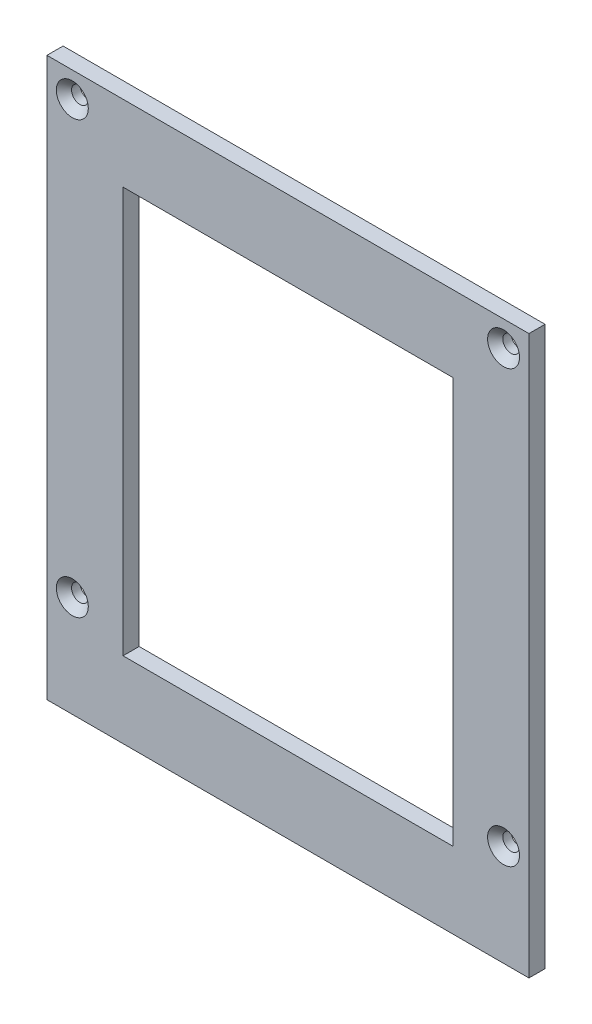
ISO-10303-21;
HEADER;
FILE_DESCRIPTION(('STEP AP214'),'2;1');
FILE_NAME('part.step','',(''),(''),'','','');
FILE_SCHEMA(('AUTOMOTIVE_DESIGN { 1 0 10303 214 1 1 1 1 }'));
ENDSEC;
DATA;
#1=APPLICATION_CONTEXT('core data for automotive mechanical design processes');
#2=APPLICATION_PROTOCOL_DEFINITION('international standard','automotive_design',2000,#1);
#3=PRODUCT_CONTEXT('',#1,'mechanical');
#4=PRODUCT('Part','Part','',(#3));
#5=PRODUCT_RELATED_PRODUCT_CATEGORY('part','',(#4));
#6=PRODUCT_DEFINITION_FORMATION('','',#4);
#7=PRODUCT_DEFINITION_CONTEXT('part definition',#1,'design');
#8=PRODUCT_DEFINITION('design','',#6,#7);
#9=PRODUCT_DEFINITION_SHAPE('','',#8);
#10=(LENGTH_UNIT() NAMED_UNIT(*) SI_UNIT(.MILLI.,.METRE.));
#11=(NAMED_UNIT(*) PLANE_ANGLE_UNIT() SI_UNIT($,.RADIAN.));
#12=(NAMED_UNIT(*) SI_UNIT($,.STERADIAN.) SOLID_ANGLE_UNIT());
#13=UNCERTAINTY_MEASURE_WITH_UNIT(LENGTH_MEASURE(1.E-05),#10,'distance_accuracy_value','');
#14=(GEOMETRIC_REPRESENTATION_CONTEXT(3) GLOBAL_UNCERTAINTY_ASSIGNED_CONTEXT((#13)) GLOBAL_UNIT_ASSIGNED_CONTEXT((#10,
#11,#12)) REPRESENTATION_CONTEXT('',''));
#15=CARTESIAN_POINT('',(0.,0.,0.));
#16=DIRECTION('',(0.,0.,1.));
#17=DIRECTION('',(1.,0.,0.));
#18=AXIS2_PLACEMENT_3D('',#15,#16,#17);
#19=CARTESIAN_POINT('',(0.,0.,6.35));
#20=DIRECTION('',(0.,0.,1.));
#21=DIRECTION('',(1.,0.,0.));
#22=AXIS2_PLACEMENT_3D('',#19,#20,#21);
#23=PLANE('',#22);
#24=CARTESIAN_POINT('',(-85.,-70.,6.35));
#25=DIRECTION('',(0.,0.,1.));
#26=DIRECTION('',(1.,0.,0.));
#27=AXIS2_PLACEMENT_3D('',#24,#25,#26);
#28=CIRCLE('',#27,6.2992);
#29=CARTESIAN_POINT('',(-78.7008,-70.,6.35));
#30=VERTEX_POINT('',#29);
#31=EDGE_CURVE('E387',#30,#30,#28,.T.);
#32=ORIENTED_EDGE('',*,*,#31,.F.);
#33=EDGE_LOOP('',(#32));
#34=FACE_BOUND('',#33,.T.);
#35=CARTESIAN_POINT('',(-85.,100.,6.35));
#36=DIRECTION('',(0.,0.,1.));
#37=DIRECTION('',(1.,0.,0.));
#38=AXIS2_PLACEMENT_3D('',#35,#36,#37);
#39=CIRCLE('',#38,6.2992);
#40=CARTESIAN_POINT('',(-78.7008,100.,6.35));
#41=VERTEX_POINT('',#40);
#42=EDGE_CURVE('E180',#41,#41,#39,.T.);
#43=ORIENTED_EDGE('',*,*,#42,.F.);
#44=EDGE_LOOP('',(#43));
#45=FACE_BOUND('',#44,.T.);
#46=CARTESIAN_POINT('',(85.,100.,6.35));
#47=DIRECTION('',(0.,0.,1.));
#48=DIRECTION('',(1.,0.,0.));
#49=AXIS2_PLACEMENT_3D('',#46,#47,#48);
#50=CIRCLE('',#49,6.2992);
#51=CARTESIAN_POINT('',(91.2992,100.,6.35));
#52=VERTEX_POINT('',#51);
#53=EDGE_CURVE('E173',#52,#52,#50,.T.);
#54=ORIENTED_EDGE('',*,*,#53,.F.);
#55=EDGE_LOOP('',(#54));
#56=FACE_BOUND('',#55,.T.);
#57=CARTESIAN_POINT('',(85.,-70.,6.35));
#58=DIRECTION('',(0.,0.,1.));
#59=DIRECTION('',(1.,0.,0.));
#60=AXIS2_PLACEMENT_3D('',#57,#58,#59);
#61=CIRCLE('',#60,6.2992);
#62=CARTESIAN_POINT('',(91.2992,-70.,6.35));
#63=VERTEX_POINT('',#62);
#64=EDGE_CURVE('E169',#63,#63,#61,.T.);
#65=ORIENTED_EDGE('',*,*,#64,.F.);
#66=EDGE_LOOP('',(#65));
#67=FACE_BOUND('',#66,.T.);
#68=DIRECTION('',(0.,-1.,0.));
#69=VECTOR('',#68,1.);
#70=CARTESIAN_POINT('',(-95.,110.,6.35));
#71=LINE('',#70,#69);
#72=CARTESIAN_POINT('',(-95.,110.,6.35));
#73=VERTEX_POINT('',#72);
#74=CARTESIAN_POINT('',(-95.,-110.,6.35));
#75=VERTEX_POINT('',#74);
#76=EDGE_CURVE('E139',#73,#75,#71,.T.);
#77=ORIENTED_EDGE('',*,*,#76,.T.);
#78=DIRECTION('',(1.,0.,0.));
#79=VECTOR('',#78,1.);
#80=CARTESIAN_POINT('',(-95.,-110.,6.35));
#81=LINE('',#80,#79);
#82=CARTESIAN_POINT('',(95.,-110.,6.35));
#83=VERTEX_POINT('',#82);
#84=EDGE_CURVE('E142',#75,#83,#81,.T.);
#85=ORIENTED_EDGE('',*,*,#84,.T.);
#86=DIRECTION('',(0.,1.,0.));
#87=VECTOR('',#86,1.);
#88=CARTESIAN_POINT('',(95.,110.,6.35));
#89=LINE('',#88,#87);
#90=CARTESIAN_POINT('',(95.,110.,6.35));
#91=VERTEX_POINT('',#90);
#92=EDGE_CURVE('E145',#83,#91,#89,.T.);
#93=ORIENTED_EDGE('',*,*,#92,.T.);
#94=DIRECTION('',(-1.,0.,0.));
#95=VECTOR('',#94,1.);
#96=CARTESIAN_POINT('',(-95.,110.,6.35));
#97=LINE('',#96,#95);
#98=EDGE_CURVE('E147',#91,#73,#97,.T.);
#99=ORIENTED_EDGE('',*,*,#98,.T.);
#100=EDGE_LOOP('',(#77,#85,#93,#99));
#101=FACE_BOUND('',#100,.T.);
#102=DIRECTION('',(1.,0.,0.));
#103=VECTOR('',#102,1.);
#104=CARTESIAN_POINT('',(-65.,-80.,6.35));
#105=LINE('',#104,#103);
#106=CARTESIAN_POINT('',(-65.,-80.,6.35));
#107=VERTEX_POINT('',#106);
#108=CARTESIAN_POINT('',(65.,-80.,6.35));
#109=VERTEX_POINT('',#108);
#110=EDGE_CURVE('E109',#107,#109,#105,.T.);
#111=ORIENTED_EDGE('',*,*,#110,.F.);
#112=DIRECTION('',(0.,-1.,0.));
#113=VECTOR('',#112,1.);
#114=CARTESIAN_POINT('',(-65.,80.,6.35));
#115=LINE('',#114,#113);
#116=CARTESIAN_POINT('',(-65.,80.,6.35));
#117=VERTEX_POINT('',#116);
#118=EDGE_CURVE('E101',#117,#107,#115,.T.);
#119=ORIENTED_EDGE('',*,*,#118,.F.);
#120=DIRECTION('',(-1.,0.,0.));
#121=VECTOR('',#120,1.);
#122=CARTESIAN_POINT('',(-65.,80.,6.35));
#123=LINE('',#122,#121);
#124=CARTESIAN_POINT('',(65.,80.,6.35));
#125=VERTEX_POINT('',#124);
#126=EDGE_CURVE('E123',#125,#117,#123,.T.);
#127=ORIENTED_EDGE('',*,*,#126,.F.);
#128=DIRECTION('',(0.,1.,0.));
#129=VECTOR('',#128,1.);
#130=CARTESIAN_POINT('',(65.,80.,6.35));
#131=LINE('',#130,#129);
#132=EDGE_CURVE('E121',#109,#125,#131,.T.);
#133=ORIENTED_EDGE('',*,*,#132,.F.);
#134=EDGE_LOOP('',(#111,#119,#127,#133));
#135=FACE_BOUND('',#134,.T.);
#136=ADVANCED_FACE('F34',(#34,#45,#56,#67,#101,#135),#23,.T.);
#137=CARTESIAN_POINT('',(0.,0.,0.));
#138=DIRECTION('',(0.,0.,1.));
#139=DIRECTION('',(1.,0.,0.));
#140=AXIS2_PLACEMENT_3D('',#137,#138,#139);
#141=PLANE('',#140);
#142=CARTESIAN_POINT('',(-85.,-70.,0.));
#143=DIRECTION('',(0.,0.,1.));
#144=DIRECTION('',(1.,0.,0.));
#145=AXIS2_PLACEMENT_3D('',#142,#143,#144);
#146=CIRCLE('',#145,3.29999999999999);
#147=CARTESIAN_POINT('',(-81.7,-70.,0.));
#148=VERTEX_POINT('',#147);
#149=EDGE_CURVE('E38',#148,#148,#146,.T.);
#150=ORIENTED_EDGE('',*,*,#149,.T.);
#151=EDGE_LOOP('',(#150));
#152=FACE_BOUND('',#151,.T.);
#153=CARTESIAN_POINT('',(-85.,100.,0.));
#154=DIRECTION('',(0.,0.,1.));
#155=DIRECTION('',(1.,0.,0.));
#156=AXIS2_PLACEMENT_3D('',#153,#154,#155);
#157=CIRCLE('',#156,3.29999999999999);
#158=CARTESIAN_POINT('',(-81.7,100.,0.));
#159=VERTEX_POINT('',#158);
#160=EDGE_CURVE('E171',#159,#159,#157,.T.);
#161=ORIENTED_EDGE('',*,*,#160,.T.);
#162=EDGE_LOOP('',(#161));
#163=FACE_BOUND('',#162,.T.);
#164=CARTESIAN_POINT('',(85.,100.,0.));
#165=DIRECTION('',(0.,0.,1.));
#166=DIRECTION('',(1.,0.,0.));
#167=AXIS2_PLACEMENT_3D('',#164,#165,#166);
#168=CIRCLE('',#167,3.29999999999999);
#169=CARTESIAN_POINT('',(88.3,100.,0.));
#170=VERTEX_POINT('',#169);
#171=EDGE_CURVE('E167',#170,#170,#168,.T.);
#172=ORIENTED_EDGE('',*,*,#171,.T.);
#173=EDGE_LOOP('',(#172));
#174=FACE_BOUND('',#173,.T.);
#175=CARTESIAN_POINT('',(85.,-70.,0.));
#176=DIRECTION('',(0.,0.,1.));
#177=DIRECTION('',(1.,0.,0.));
#178=AXIS2_PLACEMENT_3D('',#175,#176,#177);
#179=CIRCLE('',#178,3.29999999999999);
#180=CARTESIAN_POINT('',(88.3,-70.,0.));
#181=VERTEX_POINT('',#180);
#182=EDGE_CURVE('E129',#181,#181,#179,.T.);
#183=ORIENTED_EDGE('',*,*,#182,.T.);
#184=EDGE_LOOP('',(#183));
#185=FACE_BOUND('',#184,.T.);
#186=DIRECTION('',(0.,-1.,0.));
#187=VECTOR('',#186,1.);
#188=CARTESIAN_POINT('',(-95.,110.,0.));
#189=LINE('',#188,#187);
#190=CARTESIAN_POINT('',(-95.,110.,0.));
#191=VERTEX_POINT('',#190);
#192=CARTESIAN_POINT('',(-95.,-110.,0.));
#193=VERTEX_POINT('',#192);
#194=EDGE_CURVE('E117',#191,#193,#189,.T.);
#195=ORIENTED_EDGE('',*,*,#194,.F.);
#196=DIRECTION('',(-1.,0.,0.));
#197=VECTOR('',#196,1.);
#198=CARTESIAN_POINT('',(-95.,110.,0.));
#199=LINE('',#198,#197);
#200=CARTESIAN_POINT('',(95.,110.,0.));
#201=VERTEX_POINT('',#200);
#202=EDGE_CURVE('E143',#201,#191,#199,.T.);
#203=ORIENTED_EDGE('',*,*,#202,.F.);
#204=DIRECTION('',(0.,1.,0.));
#205=VECTOR('',#204,1.);
#206=CARTESIAN_POINT('',(95.,110.,0.));
#207=LINE('',#206,#205);
#208=CARTESIAN_POINT('',(95.,-110.,0.));
#209=VERTEX_POINT('',#208);
#210=EDGE_CURVE('E154',#209,#201,#207,.T.);
#211=ORIENTED_EDGE('',*,*,#210,.F.);
#212=DIRECTION('',(1.,0.,0.));
#213=VECTOR('',#212,1.);
#214=CARTESIAN_POINT('',(-95.,-110.,0.));
#215=LINE('',#214,#213);
#216=EDGE_CURVE('E152',#193,#209,#215,.T.);
#217=ORIENTED_EDGE('',*,*,#216,.F.);
#218=EDGE_LOOP('',(#195,#203,#211,#217));
#219=FACE_BOUND('',#218,.T.);
#220=DIRECTION('',(0.,-1.,0.));
#221=VECTOR('',#220,1.);
#222=CARTESIAN_POINT('',(-65.,80.,0.));
#223=LINE('',#222,#221);
#224=CARTESIAN_POINT('',(-65.,80.,0.));
#225=VERTEX_POINT('',#224);
#226=CARTESIAN_POINT('',(-65.,-80.,0.));
#227=VERTEX_POINT('',#226);
#228=EDGE_CURVE('E59',#225,#227,#223,.T.);
#229=ORIENTED_EDGE('',*,*,#228,.T.);
#230=DIRECTION('',(1.,0.,0.));
#231=VECTOR('',#230,1.);
#232=CARTESIAN_POINT('',(-65.,-80.,0.));
#233=LINE('',#232,#231);
#234=CARTESIAN_POINT('',(65.,-80.,0.));
#235=VERTEX_POINT('',#234);
#236=EDGE_CURVE('E116',#227,#235,#233,.T.);
#237=ORIENTED_EDGE('',*,*,#236,.T.);
#238=DIRECTION('',(0.,1.,0.));
#239=VECTOR('',#238,1.);
#240=CARTESIAN_POINT('',(65.,80.,0.));
#241=LINE('',#240,#239);
#242=CARTESIAN_POINT('',(65.,80.,0.));
#243=VERTEX_POINT('',#242);
#244=EDGE_CURVE('E131',#235,#243,#241,.T.);
#245=ORIENTED_EDGE('',*,*,#244,.T.);
#246=DIRECTION('',(-1.,0.,0.));
#247=VECTOR('',#246,1.);
#248=CARTESIAN_POINT('',(-65.,80.,0.));
#249=LINE('',#248,#247);
#250=EDGE_CURVE('E110',#243,#225,#249,.T.);
#251=ORIENTED_EDGE('',*,*,#250,.T.);
#252=EDGE_LOOP('',(#229,#237,#245,#251));
#253=FACE_BOUND('',#252,.T.);
#254=ADVANCED_FACE('F206',(#152,#163,#174,#185,#219,#253),#141,.F.);
#255=CARTESIAN_POINT('',(-95.,110.,6.35));
#256=DIRECTION('',(1.,0.,0.));
#257=DIRECTION('',(0.,0.,-1.));
#258=AXIS2_PLACEMENT_3D('',#255,#256,#257);
#259=PLANE('',#258);
#260=ORIENTED_EDGE('',*,*,#194,.T.);
#261=DIRECTION('',(0.,0.,-1.));
#262=VECTOR('',#261,1.);
#263=CARTESIAN_POINT('',(-95.,-110.,6.35));
#264=LINE('',#263,#262);
#265=EDGE_CURVE('E11',#75,#193,#264,.T.);
#266=ORIENTED_EDGE('',*,*,#265,.F.);
#267=ORIENTED_EDGE('',*,*,#76,.F.);
#268=DIRECTION('',(0.,0.,-1.));
#269=VECTOR('',#268,1.);
#270=CARTESIAN_POINT('',(-95.,110.,6.35));
#271=LINE('',#270,#269);
#272=EDGE_CURVE('E149',#73,#191,#271,.T.);
#273=ORIENTED_EDGE('',*,*,#272,.T.);
#274=EDGE_LOOP('',(#260,#266,#267,#273));
#275=FACE_BOUND('',#274,.T.);
#276=ADVANCED_FACE('F36',(#275),#259,.F.);
#277=CARTESIAN_POINT('',(-95.,-110.,6.35));
#278=DIRECTION('',(0.,1.,0.));
#279=DIRECTION('',(0.,0.,1.));
#280=AXIS2_PLACEMENT_3D('',#277,#278,#279);
#281=PLANE('',#280);
#282=ORIENTED_EDGE('',*,*,#216,.T.);
#283=DIRECTION('',(0.,0.,-1.));
#284=VECTOR('',#283,1.);
#285=CARTESIAN_POINT('',(95.,-110.,6.35));
#286=LINE('',#285,#284);
#287=EDGE_CURVE('E43',#83,#209,#286,.T.);
#288=ORIENTED_EDGE('',*,*,#287,.F.);
#289=ORIENTED_EDGE('',*,*,#84,.F.);
#290=ORIENTED_EDGE('',*,*,#265,.T.);
#291=EDGE_LOOP('',(#282,#288,#289,#290));
#292=FACE_BOUND('',#291,.T.);
#293=ADVANCED_FACE('F217',(#292),#281,.F.);
#294=CARTESIAN_POINT('',(95.,110.,6.35));
#295=DIRECTION('',(-1.,0.,0.));
#296=DIRECTION('',(0.,0.,1.));
#297=AXIS2_PLACEMENT_3D('',#294,#295,#296);
#298=PLANE('',#297);
#299=ORIENTED_EDGE('',*,*,#210,.T.);
#300=DIRECTION('',(0.,0.,-1.));
#301=VECTOR('',#300,1.);
#302=CARTESIAN_POINT('',(95.,110.,6.35));
#303=LINE('',#302,#301);
#304=EDGE_CURVE('E159',#91,#201,#303,.T.);
#305=ORIENTED_EDGE('',*,*,#304,.F.);
#306=ORIENTED_EDGE('',*,*,#92,.F.);
#307=ORIENTED_EDGE('',*,*,#287,.T.);
#308=EDGE_LOOP('',(#299,#305,#306,#307));
#309=FACE_BOUND('',#308,.T.);
#310=ADVANCED_FACE('F222',(#309),#298,.F.);
#311=CARTESIAN_POINT('',(-95.,110.,6.35));
#312=DIRECTION('',(0.,-1.,0.));
#313=DIRECTION('',(0.,0.,-1.));
#314=AXIS2_PLACEMENT_3D('',#311,#312,#313);
#315=PLANE('',#314);
#316=ORIENTED_EDGE('',*,*,#202,.T.);
#317=ORIENTED_EDGE('',*,*,#272,.F.);
#318=ORIENTED_EDGE('',*,*,#98,.F.);
#319=ORIENTED_EDGE('',*,*,#304,.T.);
#320=EDGE_LOOP('',(#316,#317,#318,#319));
#321=FACE_BOUND('',#320,.T.);
#322=ADVANCED_FACE('F225',(#321),#315,.F.);
#323=CARTESIAN_POINT('',(-65.,80.,6.35));
#324=DIRECTION('',(1.,0.,0.));
#325=DIRECTION('',(0.,0.,-1.));
#326=AXIS2_PLACEMENT_3D('',#323,#324,#325);
#327=PLANE('',#326);
#328=ORIENTED_EDGE('',*,*,#228,.F.);
#329=DIRECTION('',(0.,0.,-1.));
#330=VECTOR('',#329,1.);
#331=CARTESIAN_POINT('',(-65.,80.,6.35));
#332=LINE('',#331,#330);
#333=EDGE_CURVE('E105',#117,#225,#332,.T.);
#334=ORIENTED_EDGE('',*,*,#333,.F.);
#335=ORIENTED_EDGE('',*,*,#118,.T.);
#336=DIRECTION('',(0.,0.,-1.));
#337=VECTOR('',#336,1.);
#338=CARTESIAN_POINT('',(-65.,-80.,6.35));
#339=LINE('',#338,#337);
#340=EDGE_CURVE('E104',#107,#227,#339,.T.);
#341=ORIENTED_EDGE('',*,*,#340,.T.);
#342=EDGE_LOOP('',(#328,#334,#335,#341));
#343=FACE_BOUND('',#342,.T.);
#344=ADVANCED_FACE('F103',(#343),#327,.T.);
#345=CARTESIAN_POINT('',(-65.,-80.,6.35));
#346=DIRECTION('',(0.,1.,0.));
#347=DIRECTION('',(0.,0.,1.));
#348=AXIS2_PLACEMENT_3D('',#345,#346,#347);
#349=PLANE('',#348);
#350=ORIENTED_EDGE('',*,*,#236,.F.);
#351=ORIENTED_EDGE('',*,*,#340,.F.);
#352=ORIENTED_EDGE('',*,*,#110,.T.);
#353=DIRECTION('',(0.,0.,-1.));
#354=VECTOR('',#353,1.);
#355=CARTESIAN_POINT('',(65.,-80.,6.35));
#356=LINE('',#355,#354);
#357=EDGE_CURVE('E118',#109,#235,#356,.T.);
#358=ORIENTED_EDGE('',*,*,#357,.T.);
#359=EDGE_LOOP('',(#350,#351,#352,#358));
#360=FACE_BOUND('',#359,.T.);
#361=ADVANCED_FACE('F113',(#360),#349,.T.);
#362=CARTESIAN_POINT('',(65.,80.,6.35));
#363=DIRECTION('',(-1.,0.,0.));
#364=DIRECTION('',(0.,0.,1.));
#365=AXIS2_PLACEMENT_3D('',#362,#363,#364);
#366=PLANE('',#365);
#367=ORIENTED_EDGE('',*,*,#244,.F.);
#368=ORIENTED_EDGE('',*,*,#357,.F.);
#369=ORIENTED_EDGE('',*,*,#132,.T.);
#370=DIRECTION('',(0.,0.,-1.));
#371=VECTOR('',#370,1.);
#372=CARTESIAN_POINT('',(65.,80.,6.35));
#373=LINE('',#372,#371);
#374=EDGE_CURVE('E51',#125,#243,#373,.T.);
#375=ORIENTED_EDGE('',*,*,#374,.T.);
#376=EDGE_LOOP('',(#367,#368,#369,#375));
#377=FACE_BOUND('',#376,.T.);
#378=ADVANCED_FACE('F234',(#377),#366,.T.);
#379=CARTESIAN_POINT('',(-65.,80.,6.35));
#380=DIRECTION('',(0.,-1.,0.));
#381=DIRECTION('',(0.,0.,-1.));
#382=AXIS2_PLACEMENT_3D('',#379,#380,#381);
#383=PLANE('',#382);
#384=ORIENTED_EDGE('',*,*,#250,.F.);
#385=ORIENTED_EDGE('',*,*,#374,.F.);
#386=ORIENTED_EDGE('',*,*,#126,.T.);
#387=ORIENTED_EDGE('',*,*,#333,.T.);
#388=EDGE_LOOP('',(#384,#385,#386,#387));
#389=FACE_BOUND('',#388,.T.);
#390=ADVANCED_FACE('F232',(#389),#383,.T.);
#391=CARTESIAN_POINT('',(85.,-70.,6.35));
#392=DIRECTION('',(0.,0.,1.));
#393=DIRECTION('',(1.,0.,0.));
#394=AXIS2_PLACEMENT_3D('',#391,#392,#393);
#395=CYLINDRICAL_SURFACE('',#394,3.29999999999999);
#396=CARTESIAN_POINT('',(85.,-70.,3.3508));
#397=DIRECTION('',(0.,0.,1.));
#398=DIRECTION('',(1.,0.,0.));
#399=AXIS2_PLACEMENT_3D('',#396,#397,#398);
#400=CIRCLE('',#399,3.3);
#401=CARTESIAN_POINT('',(88.3,-70.,3.3508));
#402=VERTEX_POINT('',#401);
#403=EDGE_CURVE('E166',#402,#402,#400,.T.);
#404=ORIENTED_EDGE('',*,*,#403,.T.);
#405=EDGE_LOOP('',(#404));
#406=FACE_BOUND('',#405,.T.);
#407=ORIENTED_EDGE('',*,*,#182,.F.);
#408=EDGE_LOOP('',(#407));
#409=FACE_BOUND('',#408,.T.);
#410=ADVANCED_FACE('F194',(#406,#409),#395,.F.);
#411=CARTESIAN_POINT('',(85.,-70.,6.35));
#412=DIRECTION('',(0.,0.,1.));
#413=DIRECTION('',(1.,0.,0.));
#414=AXIS2_PLACEMENT_3D('',#411,#412,#413);
#415=CONICAL_SURFACE('',#414,6.2992,0.785398163397449);
#416=ORIENTED_EDGE('',*,*,#403,.F.);
#417=EDGE_LOOP('',(#416));
#418=FACE_BOUND('',#417,.T.);
#419=ORIENTED_EDGE('',*,*,#64,.T.);
#420=EDGE_LOOP('',(#419));
#421=FACE_BOUND('',#420,.T.);
#422=ADVANCED_FACE('F197',(#418,#421),#415,.F.);
#423=CARTESIAN_POINT('',(85.,100.,6.35));
#424=DIRECTION('',(0.,0.,1.));
#425=DIRECTION('',(1.,0.,0.));
#426=AXIS2_PLACEMENT_3D('',#423,#424,#425);
#427=CYLINDRICAL_SURFACE('',#426,3.29999999999999);
#428=CARTESIAN_POINT('',(85.,100.,3.3508));
#429=DIRECTION('',(0.,0.,1.));
#430=DIRECTION('',(1.,0.,0.));
#431=AXIS2_PLACEMENT_3D('',#428,#429,#430);
#432=CIRCLE('',#431,3.3);
#433=CARTESIAN_POINT('',(88.3,100.,3.3508));
#434=VERTEX_POINT('',#433);
#435=EDGE_CURVE('E170',#434,#434,#432,.T.);
#436=ORIENTED_EDGE('',*,*,#435,.T.);
#437=EDGE_LOOP('',(#436));
#438=FACE_BOUND('',#437,.T.);
#439=ORIENTED_EDGE('',*,*,#171,.F.);
#440=EDGE_LOOP('',(#439));
#441=FACE_BOUND('',#440,.T.);
#442=ADVANCED_FACE('F200',(#438,#441),#427,.F.);
#443=CARTESIAN_POINT('',(85.,100.,6.35));
#444=DIRECTION('',(0.,0.,1.));
#445=DIRECTION('',(1.,0.,0.));
#446=AXIS2_PLACEMENT_3D('',#443,#444,#445);
#447=CONICAL_SURFACE('',#446,6.2992,0.785398163397449);
#448=ORIENTED_EDGE('',*,*,#435,.F.);
#449=EDGE_LOOP('',(#448));
#450=FACE_BOUND('',#449,.T.);
#451=ORIENTED_EDGE('',*,*,#53,.T.);
#452=EDGE_LOOP('',(#451));
#453=FACE_BOUND('',#452,.T.);
#454=ADVANCED_FACE('F327',(#450,#453),#447,.F.);
#455=CARTESIAN_POINT('',(-85.,100.,6.35));
#456=DIRECTION('',(0.,0.,1.));
#457=DIRECTION('',(1.,0.,0.));
#458=AXIS2_PLACEMENT_3D('',#455,#456,#457);
#459=CYLINDRICAL_SURFACE('',#458,3.29999999999999);
#460=CARTESIAN_POINT('',(-85.,100.,3.3508));
#461=DIRECTION('',(0.,0.,1.));
#462=DIRECTION('',(1.,0.,0.));
#463=AXIS2_PLACEMENT_3D('',#460,#461,#462);
#464=CIRCLE('',#463,3.3);
#465=CARTESIAN_POINT('',(-81.7,100.,3.3508));
#466=VERTEX_POINT('',#465);
#467=EDGE_CURVE('E174',#466,#466,#464,.T.);
#468=ORIENTED_EDGE('',*,*,#467,.T.);
#469=EDGE_LOOP('',(#468));
#470=FACE_BOUND('',#469,.T.);
#471=ORIENTED_EDGE('',*,*,#160,.F.);
#472=EDGE_LOOP('',(#471));
#473=FACE_BOUND('',#472,.T.);
#474=ADVANCED_FACE('F336',(#470,#473),#459,.F.);
#475=CARTESIAN_POINT('',(-85.,100.,6.35));
#476=DIRECTION('',(0.,0.,1.));
#477=DIRECTION('',(1.,0.,0.));
#478=AXIS2_PLACEMENT_3D('',#475,#476,#477);
#479=CONICAL_SURFACE('',#478,6.2992,0.785398163397449);
#480=ORIENTED_EDGE('',*,*,#467,.F.);
#481=EDGE_LOOP('',(#480));
#482=FACE_BOUND('',#481,.T.);
#483=ORIENTED_EDGE('',*,*,#42,.T.);
#484=EDGE_LOOP('',(#483));
#485=FACE_BOUND('',#484,.T.);
#486=ADVANCED_FACE('F345',(#482,#485),#479,.F.);
#487=CARTESIAN_POINT('',(-85.,-70.,6.35));
#488=DIRECTION('',(0.,0.,1.));
#489=DIRECTION('',(1.,0.,0.));
#490=AXIS2_PLACEMENT_3D('',#487,#488,#489);
#491=CYLINDRICAL_SURFACE('',#490,3.29999999999999);
#492=CARTESIAN_POINT('',(-85.,-70.,3.3508));
#493=DIRECTION('',(0.,0.,1.));
#494=DIRECTION('',(1.,0.,0.));
#495=AXIS2_PLACEMENT_3D('',#492,#493,#494);
#496=CIRCLE('',#495,3.3);
#497=CARTESIAN_POINT('',(-81.7,-70.,3.3508));
#498=VERTEX_POINT('',#497);
#499=EDGE_CURVE('E384',#498,#498,#496,.T.);
#500=ORIENTED_EDGE('',*,*,#499,.T.);
#501=EDGE_LOOP('',(#500));
#502=FACE_BOUND('',#501,.T.);
#503=ORIENTED_EDGE('',*,*,#149,.F.);
#504=EDGE_LOOP('',(#503));
#505=FACE_BOUND('',#504,.T.);
#506=ADVANCED_FACE('F353',(#502,#505),#491,.F.);
#507=CARTESIAN_POINT('',(-85.,-70.,6.35));
#508=DIRECTION('',(0.,0.,1.));
#509=DIRECTION('',(1.,0.,0.));
#510=AXIS2_PLACEMENT_3D('',#507,#508,#509);
#511=CONICAL_SURFACE('',#510,6.2992,0.785398163397449);
#512=ORIENTED_EDGE('',*,*,#499,.F.);
#513=EDGE_LOOP('',(#512));
#514=FACE_BOUND('',#513,.T.);
#515=ORIENTED_EDGE('',*,*,#31,.T.);
#516=EDGE_LOOP('',(#515));
#517=FACE_BOUND('',#516,.T.);
#518=ADVANCED_FACE('F362',(#514,#517),#511,.F.);
#519=CLOSED_SHELL('',(#136,#254,#276,#293,#310,#322,#344,#361,#378,#390,#410,#422,#442,#454,
#474,#486,#506,#518));
#520=MANIFOLD_SOLID_BREP('B2',#519);
#521=ADVANCED_BREP_SHAPE_REPRESENTATION('',(#18,#520),#14);
#522=SHAPE_DEFINITION_REPRESENTATION(#9,#521);
ENDSEC;
END-ISO-10303-21;
